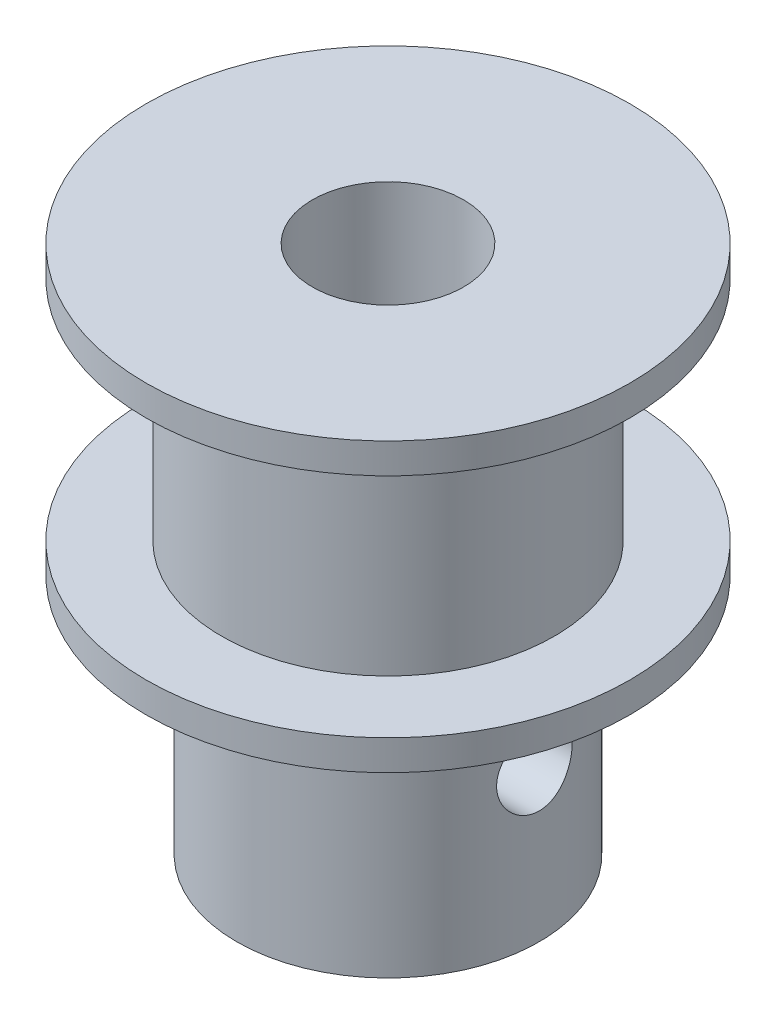
ISO-10303-21;
HEADER;
FILE_DESCRIPTION(('STEP AP214'),'2;1');
FILE_NAME('part.step','',(''),(''),'','','');
FILE_SCHEMA(('AUTOMOTIVE_DESIGN { 1 0 10303 214 1 1 1 1 }'));
ENDSEC;
DATA;
#1=APPLICATION_CONTEXT('core data for automotive mechanical design processes');
#2=APPLICATION_PROTOCOL_DEFINITION('international standard','automotive_design',2000,#1);
#3=PRODUCT_CONTEXT('',#1,'mechanical');
#4=PRODUCT('Part','Part','',(#3));
#5=PRODUCT_RELATED_PRODUCT_CATEGORY('part','',(#4));
#6=PRODUCT_DEFINITION_FORMATION('','',#4);
#7=PRODUCT_DEFINITION_CONTEXT('part definition',#1,'design');
#8=PRODUCT_DEFINITION('design','',#6,#7);
#9=PRODUCT_DEFINITION_SHAPE('','',#8);
#10=(LENGTH_UNIT() NAMED_UNIT(*) SI_UNIT(.MILLI.,.METRE.));
#11=(NAMED_UNIT(*) PLANE_ANGLE_UNIT() SI_UNIT($,.RADIAN.));
#12=(NAMED_UNIT(*) SI_UNIT($,.STERADIAN.) SOLID_ANGLE_UNIT());
#13=UNCERTAINTY_MEASURE_WITH_UNIT(LENGTH_MEASURE(1.E-05),#10,'distance_accuracy_value','');
#14=(GEOMETRIC_REPRESENTATION_CONTEXT(3) GLOBAL_UNCERTAINTY_ASSIGNED_CONTEXT((#13)) GLOBAL_UNIT_ASSIGNED_CONTEXT((#10,
#11,#12)) REPRESENTATION_CONTEXT('',''));
#15=CARTESIAN_POINT('',(0.,0.,0.));
#16=DIRECTION('',(0.,0.,1.));
#17=DIRECTION('',(1.,0.,0.));
#18=AXIS2_PLACEMENT_3D('',#15,#16,#17);
#19=CARTESIAN_POINT('',(0.,0.,0.));
#20=DIRECTION('',(0.,-1.,0.));
#21=DIRECTION('',(0.,0.,-1.));
#22=AXIS2_PLACEMENT_3D('',#19,#20,#21);
#23=CYLINDRICAL_SURFACE('',#22,2.5);
#24=CARTESIAN_POINT('',(2.16506350946109,5.,1.25000000000001));
#25=CARTESIAN_POINT('',(2.16506918410573,4.93486523975594,1.24999545384317));
#26=CARTESIAN_POINT('',(2.16804751484695,4.86964823559369,1.24487496341653));
#27=CARTESIAN_POINT('',(2.17952958065065,4.74121591915356,1.22465401237257));
#28=CARTESIAN_POINT('',(2.18804492569449,4.67800510619574,1.20953258069273));
#29=CARTESIAN_POINT('',(2.20936683256748,4.55568541957007,1.17012493587477));
#30=CARTESIAN_POINT('',(2.22215054341565,4.49655668440802,1.14588744061717));
#31=CARTESIAN_POINT('',(2.25053331021072,4.3832197475041,1.08908440672047));
#32=CARTESIAN_POINT('',(2.2661325184508,4.32901181217193,1.05651841754472));
#33=CARTESIAN_POINT('',(2.29996086321801,4.22211783930312,0.980833175663607));
#34=CARTESIAN_POINT('',(2.31830079547442,4.16992608040807,0.937065045179721));
#35=CARTESIAN_POINT('',(2.35464978482132,4.07323951449161,0.841567259518094));
#36=CARTESIAN_POINT('',(2.37265867289062,4.0287485467706,0.789833657227875));
#37=CARTESIAN_POINT('',(2.40776846191186,3.94579106106542,0.675611954268192));
#38=CARTESIAN_POINT('',(2.42472633022715,3.90793279017559,0.612633986265728));
#39=CARTESIAN_POINT('',(2.45438445124411,3.8435739334428,0.480196283249389));
#40=CARTESIAN_POINT('',(2.46708738979677,3.81706617982854,0.410740672672703));
#41=CARTESIAN_POINT('',(2.48600576555297,3.77811917337363,0.27255617990748));
#42=CARTESIAN_POINT('',(2.49261850276115,3.76481309205558,0.204127238111031));
#43=CARTESIAN_POINT('',(2.50009479807584,3.7497923516562,0.0657132858723191));
#44=CARTESIAN_POINT('',(2.50096183480737,3.74807067900536,-0.00427075730466423));
#45=CARTESIAN_POINT('',(2.49703727395563,3.75593334246294,-0.137290655529679));
#46=CARTESIAN_POINT('',(2.49273119865201,3.76454751940153,-0.20040149897098));
#47=CARTESIAN_POINT('',(2.47967806574684,3.79110105488082,-0.324142214897894));
#48=CARTESIAN_POINT('',(2.47093067582992,3.80904111122028,-0.384771901367398));
#49=CARTESIAN_POINT('',(2.44964479109568,3.85385320761227,-0.502886739461933));
#50=CARTESIAN_POINT('',(2.43705551911499,3.88084539146508,-0.560316779393964));
#51=CARTESIAN_POINT('',(2.40922057483359,3.94282927025187,-0.669971001891652));
#52=CARTESIAN_POINT('',(2.39397395196855,3.97782382912794,-0.722193311048299));
#53=CARTESIAN_POINT('',(2.36055492999037,4.05861918941627,-0.825217076122735));
#54=CARTESIAN_POINT('',(2.34224219997719,4.10512878540751,-0.875417593786692));
#55=CARTESIAN_POINT('',(2.30567925733515,4.20573715616272,-0.967630462872217));
#56=CARTESIAN_POINT('',(2.28742910332036,4.25984171534258,-1.00963651446778));
#57=CARTESIAN_POINT('',(2.25180195115606,4.37831024053011,-1.08688166830276));
#58=CARTESIAN_POINT('',(2.23455399988385,4.44310752881776,-1.12152164372256));
#59=CARTESIAN_POINT('',(2.2046931284822,4.57867208919875,-1.17914889125153));
#60=CARTESIAN_POINT('',(2.19207537557585,4.64943304127195,-1.2021483227636));
#61=CARTESIAN_POINT('',(2.17430794771293,4.78901813910349,-1.23397526378129));
#62=CARTESIAN_POINT('',(2.16864569810621,4.85755139880444,-1.24378140264996));
#63=CARTESIAN_POINT('',(2.16397399202012,4.99550167689568,-1.25189618326428));
#64=CARTESIAN_POINT('',(2.1649598361164,5.06491803639973,-1.25021294664377));
#65=CARTESIAN_POINT('',(2.17292920675731,5.19456739822341,-1.23629505417995));
#66=CARTESIAN_POINT('',(2.17924484383318,5.25497431388491,-1.22523477089058));
#67=CARTESIAN_POINT('',(2.19617526939177,5.3729597328387,-1.19462035579054));
#68=CARTESIAN_POINT('',(2.20679145006293,5.43053731343326,-1.17506347327951));
#69=CARTESIAN_POINT('',(2.23170277599571,5.54426416362837,-1.1270594857561));
#70=CARTESIAN_POINT('',(2.24614554053829,5.60022377106694,-1.0982425796159));
#71=CARTESIAN_POINT('',(2.27695149371562,5.70683658942374,-1.03285883001975));
#72=CARTESIAN_POINT('',(2.29331566693935,5.7574870543916,-0.996288005415263));
#73=CARTESIAN_POINT('',(2.3285999807042,5.85872345940444,-0.911046458998559));
#74=CARTESIAN_POINT('',(2.34758228942862,5.90849643839707,-0.8614315903937));
#75=CARTESIAN_POINT('',(2.38417793722366,5.99926529749199,-0.754255619247853));
#76=CARTESIAN_POINT('',(2.40179081259637,6.04025821278818,-0.696691843319175));
#77=CARTESIAN_POINT('',(2.43426702113696,6.11321715743763,-0.573169203198437));
#78=CARTESIAN_POINT('',(2.44904552090037,6.14491639776364,-0.507028871967632));
#79=CARTESIAN_POINT('',(2.47354193699126,6.19642237982174,-0.369402955801344));
#80=CARTESIAN_POINT('',(2.48326429595466,6.21623956420788,-0.297922126740211));
#81=CARTESIAN_POINT('',(2.49584385227353,6.24171070521833,-0.158724602913012));
#82=CARTESIAN_POINT('',(2.49924909885239,6.24849734484514,-0.0912643048130621));
#83=CARTESIAN_POINT('',(2.50052662968914,6.251054081818,0.0439074824390136));
#84=CARTESIAN_POINT('',(2.49840085083612,6.24682803565446,0.111618875368868));
#85=CARTESIAN_POINT('',(2.48917461047403,6.22822949150547,0.240672490396443));
#86=CARTESIAN_POINT('',(2.48241118334987,6.21454393842791,0.302140397264089));
#87=CARTESIAN_POINT('',(2.46490117079279,6.17834125087129,0.421807440229531));
#88=CARTESIAN_POINT('',(2.45415401415994,6.15582284988318,0.480006106194395));
#89=CARTESIAN_POINT('',(2.4290741343515,6.10159118479253,0.594279257806115));
#90=CARTESIAN_POINT('',(2.41460771498499,6.0695258459902,0.650156428375067));
#91=CARTESIAN_POINT('',(2.38360166427282,5.99755258642619,0.75596830226754));
#92=CARTESIAN_POINT('',(2.3670610819795,5.95764106360541,0.805900259268643));
#93=CARTESIAN_POINT('',(2.33160762783284,5.86650357622162,0.903642505196123));
#94=CARTESIAN_POINT('',(2.31262248764622,5.81454689065351,0.950747105674098));
#95=CARTESIAN_POINT('',(2.27578845203565,5.70318659858779,1.03582910924335));
#96=CARTESIAN_POINT('',(2.25794057202331,5.64377647391539,1.07379843751258));
#97=CARTESIAN_POINT('',(2.22499506631145,5.51670419177381,1.14053884973208));
#98=CARTESIAN_POINT('',(2.21000217820337,5.44884058608908,1.16898133245118));
#99=CARTESIAN_POINT('',(2.18582695410439,5.30833449457528,1.21359838688302));
#100=CARTESIAN_POINT('',(2.17662520184627,5.23570888885914,1.22981398896919));
#101=CARTESIAN_POINT('',(2.16911590752238,5.135243305435,1.24295875983053));
#102=CARTESIAN_POINT('',(2.16760161256439,5.10829013200265,1.24559513120482));
#103=CARTESIAN_POINT('',(2.16557419859687,5.0542293991472,1.24911675636246));
#104=CARTESIAN_POINT('',(2.16506114656386,5.02712182951766,1.25000189299985));
#105=CARTESIAN_POINT('',(2.16506350946109,5.,1.25000000000001));
#106=B_SPLINE_CURVE_WITH_KNOTS('',3,(#24,#25,#26,#27,#28,#29,#30,#31,#32,#33,#34,#35,#36,#37,
#38,#39,#40,#41,#42,#43,#44,#45,#46,#47,#48,#49,#50,#51,#52,#53,#54,#55,#56,#57,#58,#59,#60,#61,
#62,#63,#64,#65,#66,#67,#68,#69,#70,#71,#72,#73,#74,#75,#76,#77,#78,#79,#80,#81,#82,#83,#84,#85,
#86,#87,#88,#89,#90,#91,#92,#93,#94,#95,#96,#97,#98,#99,#100,#101,#102,#103,#104,#105),
.UNSPECIFIED.,.T.,.F.,(4,2,2,2,2,2,2,2,2,2,2,2,2,2,2,2,2,2,2,2,2,2,2,2,2,2,2,2,2,2,2,2,2,2,2,2,
2,2,2,2,4),(0.,0.195290153243395,0.390991116031006,0.585660744898607,0.780340906806438,
0.991077890622793,1.20191963855464,1.42697365298454,1.65188533704864,1.86079356209919,
2.0695752960755,2.26020121855673,2.45084140646819,2.64411918413933,2.8374662418784,
3.04908989321113,3.26087560307398,3.48611052161811,3.71110967764631,3.91827863567765,
4.12530116485466,4.30967729280032,4.49411315545079,4.6870912050761,4.88016857775059,
5.09758429475767,5.31507331222753,5.53830226766207,5.76133474760965,5.96390337986859,
6.16640108492465,6.35555531089366,6.54473666890016,6.7420093839934,6.93937287625899,
7.15637802312585,7.37357428556443,7.59763436298257,7.82093916253451,7.90225168981637,
7.98356965618176),.UNSPECIFIED.);
#107=CARTESIAN_POINT('',(2.16506350946109,5.,1.25000000000001));
#108=VERTEX_POINT('',#107);
#109=EDGE_CURVE('E104',#108,#108,#106,.T.);
#110=ORIENTED_EDGE('',*,*,#109,.T.);
#111=EDGE_LOOP('',(#110));
#112=FACE_BOUND('',#111,.T.);
#113=CARTESIAN_POINT('',(1.25,5.,-2.1650635094611));
#114=CARTESIAN_POINT('',(1.24999545384316,4.93486523975594,-2.16506918410574));
#115=CARTESIAN_POINT('',(1.24487496341652,4.86964823559369,-2.16804751484696));
#116=CARTESIAN_POINT('',(1.22465401237257,4.74121591915356,-2.17952958065065));
#117=CARTESIAN_POINT('',(1.20953258069272,4.67800510619574,-2.18804492569449));
#118=CARTESIAN_POINT('',(1.17012493587477,4.55568541957007,-2.20936683256748));
#119=CARTESIAN_POINT('',(1.14588744061716,4.49655668440802,-2.22215054341565));
#120=CARTESIAN_POINT('',(1.08908440672047,4.3832197475041,-2.25053331021072));
#121=CARTESIAN_POINT('',(1.05651841754472,4.32901181217193,-2.26613251845081));
#122=CARTESIAN_POINT('',(0.980833175663598,4.22211783930312,-2.29996086321802));
#123=CARTESIAN_POINT('',(0.937065045179713,4.16992608040807,-2.31830079547442));
#124=CARTESIAN_POINT('',(0.841567259518085,4.07323951449161,-2.35464978482132));
#125=CARTESIAN_POINT('',(0.789833657227866,4.0287485467706,-2.37265867289062));
#126=CARTESIAN_POINT('',(0.675611954268182,3.94579106106542,-2.40776846191186));
#127=CARTESIAN_POINT('',(0.612633986265718,3.90793279017559,-2.42472633022716));
#128=CARTESIAN_POINT('',(0.48019628324938,3.8435739334428,-2.45438445124411));
#129=CARTESIAN_POINT('',(0.410740672672694,3.81706617982854,-2.46708738979677));
#130=CARTESIAN_POINT('',(0.272556179907472,3.77811917337363,-2.48600576555297));
#131=CARTESIAN_POINT('',(0.204127238111022,3.76481309205558,-2.49261850276115));
#132=CARTESIAN_POINT('',(0.0657132858723103,3.7497923516562,-2.50009479807584));
#133=CARTESIAN_POINT('',(-0.00427075730467304,3.74807067900536,-2.50096183480737));
#134=CARTESIAN_POINT('',(-0.137290655529687,3.75593334246294,-2.49703727395563));
#135=CARTESIAN_POINT('',(-0.200401498970989,3.76454751940153,-2.492731198652));
#136=CARTESIAN_POINT('',(-0.324142214897902,3.79110105488082,-2.47967806574684));
#137=CARTESIAN_POINT('',(-0.384771901367407,3.80904111122028,-2.47093067582992));
#138=CARTESIAN_POINT('',(-0.502886739461942,3.85385320761227,-2.44964479109568));
#139=CARTESIAN_POINT('',(-0.560316779393973,3.88084539146508,-2.43705551911499));
#140=CARTESIAN_POINT('',(-0.669971001891661,3.94282927025187,-2.40922057483359));
#141=CARTESIAN_POINT('',(-0.722193311048307,3.97782382912794,-2.39397395196855));
#142=CARTESIAN_POINT('',(-0.825217076122744,4.05861918941627,-2.36055492999036));
#143=CARTESIAN_POINT('',(-0.875417593786701,4.10512878540751,-2.34224219997719));
#144=CARTESIAN_POINT('',(-0.967630462872225,4.20573715616272,-2.30567925733515));
#145=CARTESIAN_POINT('',(-1.00963651446779,4.25984171534258,-2.28742910332036));
#146=CARTESIAN_POINT('',(-1.08688166830276,4.37831024053011,-2.25180195115606));
#147=CARTESIAN_POINT('',(-1.12152164372256,4.44310752881776,-2.23455399988384));
#148=CARTESIAN_POINT('',(-1.17914889125154,4.57867208919875,-2.2046931284822));
#149=CARTESIAN_POINT('',(-1.20214832276361,4.64943304127195,-2.19207537557584));
#150=CARTESIAN_POINT('',(-1.2339752637813,4.78901813910349,-2.17430794771293));
#151=CARTESIAN_POINT('',(-1.24378140264997,4.85755139880444,-2.1686456981062));
#152=CARTESIAN_POINT('',(-1.25189618326428,4.99550167689568,-2.16397399202012));
#153=CARTESIAN_POINT('',(-1.25021294664378,5.06491803639973,-2.16495983611639));
#154=CARTESIAN_POINT('',(-1.23629505417996,5.19456739822341,-2.17292920675731));
#155=CARTESIAN_POINT('',(-1.22523477089058,5.25497431388491,-2.17924484383318));
#156=CARTESIAN_POINT('',(-1.19462035579055,5.3729597328387,-2.19617526939176));
#157=CARTESIAN_POINT('',(-1.17506347327952,5.43053731343326,-2.20679145006292));
#158=CARTESIAN_POINT('',(-1.12705948575611,5.54426416362837,-2.23170277599571));
#159=CARTESIAN_POINT('',(-1.0982425796159,5.60022377106694,-2.24614554053829));
#160=CARTESIAN_POINT('',(-1.03285883001976,5.70683658942374,-2.27695149371562));
#161=CARTESIAN_POINT('',(-0.996288005415271,5.7574870543916,-2.29331566693934));
#162=CARTESIAN_POINT('',(-0.911046458998567,5.85872345940444,-2.3285999807042));
#163=CARTESIAN_POINT('',(-0.861431590393709,5.90849643839707,-2.34758228942861));
#164=CARTESIAN_POINT('',(-0.754255619247861,5.99926529749199,-2.38417793722366));
#165=CARTESIAN_POINT('',(-0.696691843319184,6.04025821278818,-2.40179081259637));
#166=CARTESIAN_POINT('',(-0.573169203198446,6.11321715743763,-2.43426702113696));
#167=CARTESIAN_POINT('',(-0.507028871967641,6.14491639776364,-2.44904552090037));
#168=CARTESIAN_POINT('',(-0.369402955801352,6.19642237982174,-2.47354193699126));
#169=CARTESIAN_POINT('',(-0.29792212674022,6.21623956420788,-2.48326429595466));
#170=CARTESIAN_POINT('',(-0.158724602913021,6.24171070521833,-2.49584385227353));
#171=CARTESIAN_POINT('',(-0.0912643048130714,6.24849734484514,-2.49924909885239));
#172=CARTESIAN_POINT('',(0.0439074824390044,6.251054081818,-2.50052662968914));
#173=CARTESIAN_POINT('',(0.111618875368858,6.24682803565446,-2.49840085083612));
#174=CARTESIAN_POINT('',(0.240672490396434,6.22822949150547,-2.48917461047403));
#175=CARTESIAN_POINT('',(0.30214039726408,6.21454393842791,-2.48241118334987));
#176=CARTESIAN_POINT('',(0.421807440229522,6.17834125087129,-2.46490117079279));
#177=CARTESIAN_POINT('',(0.480006106194386,6.15582284988318,-2.45415401415995));
#178=CARTESIAN_POINT('',(0.594279257806106,6.10159118479253,-2.4290741343515));
#179=CARTESIAN_POINT('',(0.650156428375059,6.0695258459902,-2.41460771498499));
#180=CARTESIAN_POINT('',(0.755968302267532,5.99755258642619,-2.38360166427283));
#181=CARTESIAN_POINT('',(0.805900259268634,5.95764106360541,-2.36706108197951));
#182=CARTESIAN_POINT('',(0.903642505196114,5.86650357622162,-2.33160762783285));
#183=CARTESIAN_POINT('',(0.95074710567409,5.81454689065351,-2.31262248764622));
#184=CARTESIAN_POINT('',(1.03582910924334,5.70318659858779,-2.27578845203565));
#185=CARTESIAN_POINT('',(1.07379843751257,5.6437764739154,-2.25794057202332));
#186=CARTESIAN_POINT('',(1.14053884973207,5.51670419177381,-2.22499506631145));
#187=CARTESIAN_POINT('',(1.16898133245117,5.44884058608908,-2.21000217820338));
#188=CARTESIAN_POINT('',(1.21359838688301,5.30833449457528,-2.18582695410439));
#189=CARTESIAN_POINT('',(1.22981398896918,5.23570888885914,-2.17662520184627));
#190=CARTESIAN_POINT('',(1.24295875983052,5.135243305435,-2.16911590752238));
#191=CARTESIAN_POINT('',(1.24559513120481,5.10829013200265,-2.1676016125644));
#192=CARTESIAN_POINT('',(1.24911675636245,5.0542293991472,-2.16557419859688));
#193=CARTESIAN_POINT('',(1.25000189299984,5.02712182951766,-2.16506114656387));
#194=CARTESIAN_POINT('',(1.25,5.,-2.1650635094611));
#195=B_SPLINE_CURVE_WITH_KNOTS('',3,(#113,#114,#115,#116,#117,#118,#119,#120,#121,#122,#123,
#124,#125,#126,#127,#128,#129,#130,#131,#132,#133,#134,#135,#136,#137,#138,#139,#140,#141,#142,
#143,#144,#145,#146,#147,#148,#149,#150,#151,#152,#153,#154,#155,#156,#157,#158,#159,#160,#161,
#162,#163,#164,#165,#166,#167,#168,#169,#170,#171,#172,#173,#174,#175,#176,#177,#178,#179,#180,
#181,#182,#183,#184,#185,#186,#187,#188,#189,#190,#191,#192,#193,#194),.UNSPECIFIED.,.T.,.F.,(4,
2,2,2,2,2,2,2,2,2,2,2,2,2,2,2,2,2,2,2,2,2,2,2,2,2,2,2,2,2,2,2,2,2,2,2,2,2,2,2,4),(0.,
0.195290153243395,0.390991116031006,0.585660744898607,0.780340906806438,0.991077890622794,
1.20191963855464,1.42697365298454,1.65188533704864,1.86079356209919,2.0695752960755,
2.26020121855673,2.45084140646819,2.64411918413933,2.8374662418784,3.04908989321113,
3.26087560307398,3.48611052161811,3.71110967764631,3.91827863567765,4.12530116485466,
4.30967729280032,4.49411315545079,4.6870912050761,4.88016857775059,5.09758429475767,
5.31507331222753,5.53830226766207,5.76133474760965,5.96390337986859,6.16640108492465,
6.35555531089366,6.54473666890016,6.7420093839934,6.93937287625899,7.15637802312585,
7.37357428556443,7.59763436298256,7.82093916253451,7.90225168981637,7.98356965618176),.UNSPECIFIED.);
#196=CARTESIAN_POINT('',(1.25,5.,-2.1650635094611));
#197=VERTEX_POINT('',#196);
#198=EDGE_CURVE('E71',#197,#197,#195,.T.);
#199=ORIENTED_EDGE('',*,*,#198,.T.);
#200=EDGE_LOOP('',(#199));
#201=FACE_BOUND('',#200,.T.);
#202=CARTESIAN_POINT('',(0.,0.,0.));
#203=DIRECTION('',(0.,-1.,0.));
#204=DIRECTION('',(0.,0.,-1.));
#205=AXIS2_PLACEMENT_3D('',#202,#203,#204);
#206=CIRCLE('',#205,2.5);
#207=CARTESIAN_POINT('',(0.,0.,-2.5));
#208=VERTEX_POINT('',#207);
#209=EDGE_CURVE('E68',#208,#208,#206,.T.);
#210=ORIENTED_EDGE('',*,*,#209,.T.);
#211=EDGE_LOOP('',(#210));
#212=FACE_BOUND('',#211,.T.);
#213=CARTESIAN_POINT('',(0.,17.5,0.));
#214=DIRECTION('',(0.,-1.,0.));
#215=DIRECTION('',(0.,0.,-1.));
#216=AXIS2_PLACEMENT_3D('',#213,#214,#215);
#217=CIRCLE('',#216,2.5);
#218=CARTESIAN_POINT('',(0.,17.5,-2.5));
#219=VERTEX_POINT('',#218);
#220=EDGE_CURVE('E10',#219,#219,#217,.T.);
#221=ORIENTED_EDGE('',*,*,#220,.F.);
#222=EDGE_LOOP('',(#221));
#223=FACE_BOUND('',#222,.T.);
#224=ADVANCED_FACE('F34',(#112,#201,#212,#223),#23,.F.);
#225=CARTESIAN_POINT('',(2.5,17.5,0.));
#226=DIRECTION('',(0.,1.,0.));
#227=DIRECTION('',(0.,0.,1.));
#228=AXIS2_PLACEMENT_3D('',#225,#226,#227);
#229=PLANE('',#228);
#230=ORIENTED_EDGE('',*,*,#220,.T.);
#231=EDGE_LOOP('',(#230));
#232=FACE_BOUND('',#231,.T.);
#233=CARTESIAN_POINT('',(0.,17.5,0.));
#234=DIRECTION('',(0.,-1.,0.));
#235=DIRECTION('',(0.,0.,-1.));
#236=AXIS2_PLACEMENT_3D('',#233,#234,#235);
#237=CIRCLE('',#236,8.);
#238=CARTESIAN_POINT('',(0.,17.5,-8.));
#239=VERTEX_POINT('',#238);
#240=EDGE_CURVE('E40',#239,#239,#237,.T.);
#241=ORIENTED_EDGE('',*,*,#240,.F.);
#242=EDGE_LOOP('',(#241));
#243=FACE_BOUND('',#242,.T.);
#244=ADVANCED_FACE('F134',(#232,#243),#229,.T.);
#245=CARTESIAN_POINT('',(0.,0.,0.));
#246=DIRECTION('',(0.,-1.,0.));
#247=DIRECTION('',(0.,0.,-1.));
#248=AXIS2_PLACEMENT_3D('',#245,#246,#247);
#249=CYLINDRICAL_SURFACE('',#248,8.);
#250=ORIENTED_EDGE('',*,*,#240,.T.);
#251=EDGE_LOOP('',(#250));
#252=FACE_BOUND('',#251,.T.);
#253=CARTESIAN_POINT('',(0.,16.5,0.));
#254=DIRECTION('',(0.,-1.,0.));
#255=DIRECTION('',(0.,0.,-1.));
#256=AXIS2_PLACEMENT_3D('',#253,#254,#255);
#257=CIRCLE('',#256,8.);
#258=CARTESIAN_POINT('',(0.,16.5,-8.));
#259=VERTEX_POINT('',#258);
#260=EDGE_CURVE('E44',#259,#259,#257,.T.);
#261=ORIENTED_EDGE('',*,*,#260,.F.);
#262=EDGE_LOOP('',(#261));
#263=FACE_BOUND('',#262,.T.);
#264=ADVANCED_FACE('F138',(#252,#263),#249,.T.);
#265=CARTESIAN_POINT('',(8.,16.5,0.));
#266=DIRECTION('',(0.,-1.,0.));
#267=DIRECTION('',(0.,0.,-1.));
#268=AXIS2_PLACEMENT_3D('',#265,#266,#267);
#269=PLANE('',#268);
#270=ORIENTED_EDGE('',*,*,#260,.T.);
#271=EDGE_LOOP('',(#270));
#272=FACE_BOUND('',#271,.T.);
#273=CARTESIAN_POINT('',(0.,16.5,0.));
#274=DIRECTION('',(0.,-1.,0.));
#275=DIRECTION('',(0.,0.,-1.));
#276=AXIS2_PLACEMENT_3D('',#273,#274,#275);
#277=CIRCLE('',#276,5.5);
#278=CARTESIAN_POINT('',(0.,16.5,-5.5));
#279=VERTEX_POINT('',#278);
#280=EDGE_CURVE('E48',#279,#279,#277,.T.);
#281=ORIENTED_EDGE('',*,*,#280,.F.);
#282=EDGE_LOOP('',(#281));
#283=FACE_BOUND('',#282,.T.);
#284=ADVANCED_FACE('F212',(#272,#283),#269,.T.);
#285=CARTESIAN_POINT('',(0.,0.,0.));
#286=DIRECTION('',(0.,-1.,0.));
#287=DIRECTION('',(0.,0.,-1.));
#288=AXIS2_PLACEMENT_3D('',#285,#286,#287);
#289=CYLINDRICAL_SURFACE('',#288,5.5);
#290=ORIENTED_EDGE('',*,*,#280,.T.);
#291=EDGE_LOOP('',(#290));
#292=FACE_BOUND('',#291,.T.);
#293=CARTESIAN_POINT('',(0.,9.,0.));
#294=DIRECTION('',(0.,-1.,0.));
#295=DIRECTION('',(0.,0.,-1.));
#296=AXIS2_PLACEMENT_3D('',#293,#294,#295);
#297=CIRCLE('',#296,5.5);
#298=CARTESIAN_POINT('',(0.,9.,-5.5));
#299=VERTEX_POINT('',#298);
#300=EDGE_CURVE('E53',#299,#299,#297,.T.);
#301=ORIENTED_EDGE('',*,*,#300,.F.);
#302=EDGE_LOOP('',(#301));
#303=FACE_BOUND('',#302,.T.);
#304=ADVANCED_FACE('F202',(#292,#303),#289,.T.);
#305=CARTESIAN_POINT('',(5.5,9.,0.));
#306=DIRECTION('',(0.,1.,0.));
#307=DIRECTION('',(0.,0.,1.));
#308=AXIS2_PLACEMENT_3D('',#305,#306,#307);
#309=PLANE('',#308);
#310=ORIENTED_EDGE('',*,*,#300,.T.);
#311=EDGE_LOOP('',(#310));
#312=FACE_BOUND('',#311,.T.);
#313=CARTESIAN_POINT('',(0.,9.,0.));
#314=DIRECTION('',(0.,-1.,0.));
#315=DIRECTION('',(0.,0.,-1.));
#316=AXIS2_PLACEMENT_3D('',#313,#314,#315);
#317=CIRCLE('',#316,8.);
#318=CARTESIAN_POINT('',(0.,9.,-8.));
#319=VERTEX_POINT('',#318);
#320=EDGE_CURVE('E56',#319,#319,#317,.T.);
#321=ORIENTED_EDGE('',*,*,#320,.F.);
#322=EDGE_LOOP('',(#321));
#323=FACE_BOUND('',#322,.T.);
#324=ADVANCED_FACE('F192',(#312,#323),#309,.T.);
#325=CARTESIAN_POINT('',(0.,0.,0.));
#326=DIRECTION('',(0.,-1.,0.));
#327=DIRECTION('',(0.,0.,-1.));
#328=AXIS2_PLACEMENT_3D('',#325,#326,#327);
#329=CYLINDRICAL_SURFACE('',#328,8.);
#330=ORIENTED_EDGE('',*,*,#320,.T.);
#331=EDGE_LOOP('',(#330));
#332=FACE_BOUND('',#331,.T.);
#333=CARTESIAN_POINT('',(0.,8.,0.));
#334=DIRECTION('',(0.,-1.,0.));
#335=DIRECTION('',(0.,0.,-1.));
#336=AXIS2_PLACEMENT_3D('',#333,#334,#335);
#337=CIRCLE('',#336,8.);
#338=CARTESIAN_POINT('',(0.,8.,-8.));
#339=VERTEX_POINT('',#338);
#340=EDGE_CURVE('E59',#339,#339,#337,.T.);
#341=ORIENTED_EDGE('',*,*,#340,.F.);
#342=EDGE_LOOP('',(#341));
#343=FACE_BOUND('',#342,.T.);
#344=ADVANCED_FACE('F182',(#332,#343),#329,.T.);
#345=CARTESIAN_POINT('',(8.,8.,0.));
#346=DIRECTION('',(0.,-1.,0.));
#347=DIRECTION('',(0.,0.,-1.));
#348=AXIS2_PLACEMENT_3D('',#345,#346,#347);
#349=PLANE('',#348);
#350=ORIENTED_EDGE('',*,*,#340,.T.);
#351=EDGE_LOOP('',(#350));
#352=FACE_BOUND('',#351,.T.);
#353=CARTESIAN_POINT('',(0.,8.,0.));
#354=DIRECTION('',(0.,-1.,0.));
#355=DIRECTION('',(0.,0.,-1.));
#356=AXIS2_PLACEMENT_3D('',#353,#354,#355);
#357=CIRCLE('',#356,5.);
#358=CARTESIAN_POINT('',(0.,8.,-5.));
#359=VERTEX_POINT('',#358);
#360=EDGE_CURVE('E62',#359,#359,#357,.T.);
#361=ORIENTED_EDGE('',*,*,#360,.F.);
#362=EDGE_LOOP('',(#361));
#363=FACE_BOUND('',#362,.T.);
#364=ADVANCED_FACE('F120',(#352,#363),#349,.T.);
#365=CARTESIAN_POINT('',(0.,0.,0.));
#366=DIRECTION('',(0.,-1.,0.));
#367=DIRECTION('',(0.,0.,-1.));
#368=AXIS2_PLACEMENT_3D('',#365,#366,#367);
#369=CYLINDRICAL_SURFACE('',#368,5.);
#370=CARTESIAN_POINT('',(4.84122918275927,5.,1.25000000000002));
#371=CARTESIAN_POINT('',(4.84123050042654,5.0690253754623,1.24999803929591));
#372=CARTESIAN_POINT('',(4.84272153006956,5.138072449339,1.24426312274867));
#373=CARTESIAN_POINT('',(4.84850930996624,5.27418378908702,1.22151156273209));
#374=CARTESIAN_POINT('',(4.85280769310906,5.34124687723416,1.20448835337112));
#375=CARTESIAN_POINT('',(4.86369362297983,5.47140176909352,1.15974559981599));
#376=CARTESIAN_POINT('',(4.87027821345204,5.53449857769284,1.13203986392725));
#377=CARTESIAN_POINT('',(4.88499096014404,5.65515542626996,1.06676057063072));
#378=CARTESIAN_POINT('',(4.89311918189251,5.71271523104011,1.02918659428036));
#379=CARTESIAN_POINT('',(4.91020358177805,5.8219308226311,0.944354213655954));
#380=CARTESIAN_POINT('',(4.91917298811515,5.87344680017502,0.896918443852042));
#381=CARTESIAN_POINT('',(4.93681437757648,5.96788069718017,0.794091032050349));
#382=CARTESIAN_POINT('',(4.94548633283194,6.01079781281087,0.738698647090171));
#383=CARTESIAN_POINT('',(4.96170207760291,6.08738773381564,0.620572600539494));
#384=CARTESIAN_POINT('',(4.96922843700296,6.12092319408073,0.557747288097577));
#385=CARTESIAN_POINT('',(4.98215405962992,6.17690482207654,0.427131592146399));
#386=CARTESIAN_POINT('',(4.98755363667172,6.19935262595776,0.359341942895988));
#387=CARTESIAN_POINT('',(4.9955237942409,6.23207391728929,0.222179379377099));
#388=CARTESIAN_POINT('',(4.99814946922157,6.24258482216329,0.152866359774505));
#389=CARTESIAN_POINT('',(5.00046797053649,6.25187918963778,0.0134144096314023));
#390=CARTESIAN_POINT('',(5.00016123048352,6.2506643861048,-0.0567243972690167));
#391=CARTESIAN_POINT('',(4.99669047476767,6.23671257487493,-0.194190308965467));
#392=CARTESIAN_POINT('',(4.99359001170437,6.22423183747307,-0.261545269501316));
#393=CARTESIAN_POINT('',(4.98495418262427,6.18851436497575,-0.39317280926709));
#394=CARTESIAN_POINT('',(4.97941868699221,6.1652770573113,-0.45744522421303));
#395=CARTESIAN_POINT('',(4.96643754850448,6.10849871465647,-0.581758379377241));
#396=CARTESIAN_POINT('',(4.95897509847527,6.07486647766913,-0.641755637208114));
#397=CARTESIAN_POINT('',(4.94294951904825,5.99832216044187,-0.755344527925594));
#398=CARTESIAN_POINT('',(4.93438619826245,5.95540846571969,-0.808935043856865));
#399=CARTESIAN_POINT('',(4.91681856884761,5.86014562900881,-0.909717543856179));
#400=CARTESIAN_POINT('',(4.90780859762959,5.80757255382611,-0.956697098843982));
#401=CARTESIAN_POINT('',(4.89057521758354,5.69520001322987,-1.04122046995376));
#402=CARTESIAN_POINT('',(4.88235184552986,5.6354002102545,-1.0787638450575));
#403=CARTESIAN_POINT('',(4.86760248415825,5.50985498292552,-1.14348516127823));
#404=CARTESIAN_POINT('',(4.86108491862861,5.4440821348434,-1.1706119587131));
#405=CARTESIAN_POINT('',(4.85059320069979,5.30870726596177,-1.21335702579541));
#406=CARTESIAN_POINT('',(4.8466185040511,5.23910606800843,-1.22897775819112));
#407=CARTESIAN_POINT('',(4.84177678019571,5.10002024923844,-1.24791481933257));
#408=CARTESIAN_POINT('',(4.84083044546825,5.03058110333519,-1.2515452369598));
#409=CARTESIAN_POINT('',(4.8419367174052,4.89208903171092,-1.24725849525776));
#410=CARTESIAN_POINT('',(4.84398904800633,4.82303607102438,-1.23934239892438));
#411=CARTESIAN_POINT('',(4.85078540977281,4.68844286752265,-1.21246273196881));
#412=CARTESIAN_POINT('',(4.85548485117188,4.62286363671458,-1.19368203414086));
#413=CARTESIAN_POINT('',(4.86700359135482,4.49578427107416,-1.14580904083529));
#414=CARTESIAN_POINT('',(4.87382314124307,4.43428462047233,-1.11671552385626));
#415=CARTESIAN_POINT('',(4.88898068546632,4.31577936106633,-1.04838533396826));
#416=CARTESIAN_POINT('',(4.89734584303321,4.25888557997845,-1.0089608769178));
#417=CARTESIAN_POINT('',(4.91458541535858,4.15240581859932,-0.921325366168052));
#418=CARTESIAN_POINT('',(4.92345991364235,4.10282104167496,-0.873112868506782));
#419=CARTESIAN_POINT('',(4.94098701515803,4.01109447871452,-0.767828401230889));
#420=CARTESIAN_POINT('',(4.94962851030918,3.96916996872559,-0.710564940664473));
#421=CARTESIAN_POINT('',(4.96548608306867,3.89553206652438,-0.589628353368326));
#422=CARTESIAN_POINT('',(4.9727022350198,3.8638181416959,-0.525955561196971));
#423=CARTESIAN_POINT('',(4.98485057869157,3.81177698273603,-0.394447752163845));
#424=CARTESIAN_POINT('',(4.98979915011205,3.79136785781047,-0.326646726284834));
#425=CARTESIAN_POINT('',(4.99692646697894,3.76226983269579,-0.188437200398492));
#426=CARTESIAN_POINT('',(4.99910574696704,3.75357867063047,-0.118029206301537));
#427=CARTESIAN_POINT('',(5.00042711761014,3.74829051303058,0.0213544080541759));
#428=CARTESIAN_POINT('',(4.9996497360001,3.75137286363076,0.0903172837075593));
#429=CARTESIAN_POINT('',(4.9953237057178,3.76880978411791,0.226709370518442));
#430=CARTESIAN_POINT('',(4.99177513946369,3.78316401876638,0.294138627226126));
#431=CARTESIAN_POINT('',(4.98231791067453,3.82256527471366,0.425213794556038));
#432=CARTESIAN_POINT('',(4.97642205628333,3.84755431664328,0.488878118226291));
#433=CARTESIAN_POINT('',(4.9628911114173,3.90746322377416,0.611146316301853));
#434=CARTESIAN_POINT('',(4.9552558017217,3.94238434083696,0.669749551581332));
#435=CARTESIAN_POINT('',(4.93884062101666,4.02214404249634,0.781752410529892));
#436=CARTESIAN_POINT('',(4.93003771182014,4.06720017863422,0.834993735375748));
#437=CARTESIAN_POINT('',(4.91238311316552,4.16552856496725,0.933268775339087));
#438=CARTESIAN_POINT('',(4.90353141190695,4.21880289512238,0.978300406335254));
#439=CARTESIAN_POINT('',(4.88659344825685,4.33325176775167,1.05970253309905));
#440=CARTESIAN_POINT('',(4.87852454662355,4.39455515426578,1.0958957743082));
#441=CARTESIAN_POINT('',(4.86429944438269,4.52256936240338,1.1574086207696));
#442=CARTESIAN_POINT('',(4.85814185308378,4.58927620763343,1.18273613719967));
#443=CARTESIAN_POINT('',(4.84939885924729,4.7132212647834,1.21802816070682));
#444=CARTESIAN_POINT('',(4.84635828750683,4.76986645547983,1.22999146324424));
#445=CARTESIAN_POINT('',(4.84227298231965,4.88433608624995,1.2459778657166));
#446=CARTESIAN_POINT('',(4.84122807862453,4.94216042530633,1.25000164296525));
#447=CARTESIAN_POINT('',(4.84122918275927,5.,1.25000000000002));
#448=B_SPLINE_CURVE_WITH_KNOTS('',3,(#370,#371,#372,#373,#374,#375,#376,#377,#378,#379,#380,
#381,#382,#383,#384,#385,#386,#387,#388,#389,#390,#391,#392,#393,#394,#395,#396,#397,#398,#399,
#400,#401,#402,#403,#404,#405,#406,#407,#408,#409,#410,#411,#412,#413,#414,#415,#416,#417,#418,
#419,#420,#421,#422,#423,#424,#425,#426,#427,#428,#429,#430,#431,#432,#433,#434,#435,#436,#437,
#438,#439,#440,#441,#442,#443,#444,#445,#446,#447),.UNSPECIFIED.,.T.,.F.,(4,2,2,2,2,2,2,2,2,2,2,
2,2,2,2,2,2,2,2,2,2,2,2,2,2,2,2,2,2,2,2,2,2,2,2,2,2,2,4),(0.,0.206863720868067,
0.413847870714333,0.620565363583011,0.827291633777393,1.03811977096488,1.24896760739933,
1.4627574819896,1.67651579923546,1.88594375497673,2.0953407433301,2.30009131344474,
2.50485278362393,2.71146437127222,2.91811192734457,3.13035233285956,3.34260265599901,
3.55588216004201,3.76911600064774,3.97671787380859,4.18430063591901,4.38848702504604,
4.59269760710709,4.80091422929579,5.00916509442523,5.2226266548266,5.43607707859777,
5.64796036403465,5.85980274454519,6.06591723063729,6.27202558688491,6.47702438279856,
6.68204902869036,6.89198548291036,7.10197515782755,7.31588238642339,7.5296336068331,
7.70298913588665,7.87632987549761),.UNSPECIFIED.);
#449=CARTESIAN_POINT('',(4.84122918275927,5.,1.25000000000002));
#450=VERTEX_POINT('',#449);
#451=EDGE_CURVE('E100',#450,#450,#448,.T.);
#452=ORIENTED_EDGE('',*,*,#451,.T.);
#453=EDGE_LOOP('',(#452));
#454=FACE_BOUND('',#453,.T.);
#455=CARTESIAN_POINT('',(1.25,5.,-4.84122918275927));
#456=CARTESIAN_POINT('',(1.24999803929589,5.0690253754623,-4.84123050042654));
#457=CARTESIAN_POINT('',(1.24426312274865,5.138072449339,-4.84272153006957));
#458=CARTESIAN_POINT('',(1.22151156273207,5.27418378908702,-4.84850930996624));
#459=CARTESIAN_POINT('',(1.2044883533711,5.34124687723416,-4.85280769310907));
#460=CARTESIAN_POINT('',(1.15974559981597,5.47140176909352,-4.86369362297984));
#461=CARTESIAN_POINT('',(1.13203986392723,5.53449857769284,-4.87027821345204));
#462=CARTESIAN_POINT('',(1.0667605706307,5.65515542626996,-4.88499096014404));
#463=CARTESIAN_POINT('',(1.02918659428035,5.71271523104011,-4.89311918189251));
#464=CARTESIAN_POINT('',(0.944354213655937,5.8219308226311,-4.91020358177806));
#465=CARTESIAN_POINT('',(0.896918443852024,5.87344680017502,-4.91917298811515));
#466=CARTESIAN_POINT('',(0.794091032050331,5.96788069718017,-4.93681437757649));
#467=CARTESIAN_POINT('',(0.738698647090152,6.01079781281087,-4.94548633283195));
#468=CARTESIAN_POINT('',(0.620572600539476,6.08738773381564,-4.96170207760291));
#469=CARTESIAN_POINT('',(0.557747288097559,6.12092319408073,-4.96922843700296));
#470=CARTESIAN_POINT('',(0.427131592146381,6.17690482207654,-4.98215405962992));
#471=CARTESIAN_POINT('',(0.35934194289597,6.19935262595776,-4.98755363667172));
#472=CARTESIAN_POINT('',(0.222179379377081,6.23207391728929,-4.9955237942409));
#473=CARTESIAN_POINT('',(0.152866359774488,6.24258482216329,-4.99814946922157));
#474=CARTESIAN_POINT('',(0.0134144096313846,6.25187918963778,-5.00046797053649));
#475=CARTESIAN_POINT('',(-0.0567243972690342,6.2506643861048,-5.00016123048352));
#476=CARTESIAN_POINT('',(-0.194190308965484,6.23671257487493,-4.99669047476767));
#477=CARTESIAN_POINT('',(-0.261545269501334,6.22423183747307,-4.99359001170437));
#478=CARTESIAN_POINT('',(-0.393172809267108,6.18851436497575,-4.98495418262427));
#479=CARTESIAN_POINT('',(-0.457445224213047,6.1652770573113,-4.97941868699221));
#480=CARTESIAN_POINT('',(-0.581758379377258,6.10849871465647,-4.96643754850448));
#481=CARTESIAN_POINT('',(-0.64175563720813,6.07486647766913,-4.95897509847527));
#482=CARTESIAN_POINT('',(-0.755344527925611,5.99832216044187,-4.94294951904825));
#483=CARTESIAN_POINT('',(-0.808935043856882,5.95540846571969,-4.93438619826245));
#484=CARTESIAN_POINT('',(-0.909717543856195,5.86014562900881,-4.9168185688476));
#485=CARTESIAN_POINT('',(-0.956697098843999,5.80757255382611,-4.90780859762959));
#486=CARTESIAN_POINT('',(-1.04122046995377,5.69520001322987,-4.89057521758353));
#487=CARTESIAN_POINT('',(-1.07876384505752,5.6354002102545,-4.88235184552985));
#488=CARTESIAN_POINT('',(-1.14348516127825,5.50985498292552,-4.86760248415824));
#489=CARTESIAN_POINT('',(-1.17061195871311,5.4440821348434,-4.8610849186286));
#490=CARTESIAN_POINT('',(-1.21335702579543,5.30870726596177,-4.85059320069979));
#491=CARTESIAN_POINT('',(-1.22897775819114,5.23910606800843,-4.84661850405109));
#492=CARTESIAN_POINT('',(-1.24791481933259,5.10002024923844,-4.8417767801957));
#493=CARTESIAN_POINT('',(-1.25154523695981,5.03058110333519,-4.84083044546824));
#494=CARTESIAN_POINT('',(-1.24725849525777,4.89208903171092,-4.8419367174052));
#495=CARTESIAN_POINT('',(-1.2393423989244,4.82303607102438,-4.84398904800633));
#496=CARTESIAN_POINT('',(-1.21246273196883,4.68844286752265,-4.8507854097728));
#497=CARTESIAN_POINT('',(-1.19368203414087,4.62286363671458,-4.85548485117188));
#498=CARTESIAN_POINT('',(-1.14580904083531,4.49578427107416,-4.86700359135481));
#499=CARTESIAN_POINT('',(-1.11671552385627,4.43428462047233,-4.87382314124307));
#500=CARTESIAN_POINT('',(-1.04838533396828,4.31577936106633,-4.88898068546631));
#501=CARTESIAN_POINT('',(-1.00896087691781,4.25888557997845,-4.89734584303321));
#502=CARTESIAN_POINT('',(-0.921325366168069,4.15240581859932,-4.91458541535858));
#503=CARTESIAN_POINT('',(-0.873112868506799,4.10282104167496,-4.92345991364235));
#504=CARTESIAN_POINT('',(-0.767828401230907,4.01109447871452,-4.94098701515803));
#505=CARTESIAN_POINT('',(-0.710564940664491,3.96916996872559,-4.94962851030918));
#506=CARTESIAN_POINT('',(-0.589628353368344,3.89553206652438,-4.96548608306867));
#507=CARTESIAN_POINT('',(-0.525955561196989,3.8638181416959,-4.9727022350198));
#508=CARTESIAN_POINT('',(-0.394447752163863,3.81177698273603,-4.98485057869157));
#509=CARTESIAN_POINT('',(-0.326646726284852,3.79136785781047,-4.98979915011205));
#510=CARTESIAN_POINT('',(-0.18843720039851,3.76226983269579,-4.99692646697894));
#511=CARTESIAN_POINT('',(-0.118029206301555,3.75357867063047,-4.99910574696704));
#512=CARTESIAN_POINT('',(0.0213544080541577,3.74829051303058,-5.00042711761014));
#513=CARTESIAN_POINT('',(0.090317283707541,3.75137286363076,-4.99964973600011));
#514=CARTESIAN_POINT('',(0.226709370518424,3.76880978411791,-4.9953237057178));
#515=CARTESIAN_POINT('',(0.294138627226108,3.78316401876638,-4.99177513946369));
#516=CARTESIAN_POINT('',(0.42521379455602,3.82256527471366,-4.98231791067453));
#517=CARTESIAN_POINT('',(0.488878118226274,3.84755431664328,-4.97642205628333));
#518=CARTESIAN_POINT('',(0.611146316301836,3.90746322377416,-4.9628911114173));
#519=CARTESIAN_POINT('',(0.669749551581314,3.94238434083696,-4.9552558017217));
#520=CARTESIAN_POINT('',(0.781752410529874,4.02214404249634,-4.93884062101666));
#521=CARTESIAN_POINT('',(0.83499373537573,4.06720017863422,-4.93003771182014));
#522=CARTESIAN_POINT('',(0.933268775339069,4.16552856496725,-4.91238311316553));
#523=CARTESIAN_POINT('',(0.978300406335237,4.21880289512238,-4.90353141190695));
#524=CARTESIAN_POINT('',(1.05970253309904,4.33325176775166,-4.88659344825685));
#525=CARTESIAN_POINT('',(1.09589577430819,4.39455515426578,-4.87852454662356));
#526=CARTESIAN_POINT('',(1.15740862076958,4.52256936240338,-4.8642994443827));
#527=CARTESIAN_POINT('',(1.18273613719965,4.58927620763343,-4.85814185308379));
#528=CARTESIAN_POINT('',(1.2180281607068,4.7132212647834,-4.84939885924729));
#529=CARTESIAN_POINT('',(1.22999146324422,4.76986645547983,-4.84635828750683));
#530=CARTESIAN_POINT('',(1.24597786571659,4.88433608624995,-4.84227298231965));
#531=CARTESIAN_POINT('',(1.25000164296523,4.94216042530633,-4.84122807862454));
#532=CARTESIAN_POINT('',(1.25,5.,-4.84122918275927));
#533=B_SPLINE_CURVE_WITH_KNOTS('',3,(#455,#456,#457,#458,#459,#460,#461,#462,#463,#464,#465,
#466,#467,#468,#469,#470,#471,#472,#473,#474,#475,#476,#477,#478,#479,#480,#481,#482,#483,#484,
#485,#486,#487,#488,#489,#490,#491,#492,#493,#494,#495,#496,#497,#498,#499,#500,#501,#502,#503,
#504,#505,#506,#507,#508,#509,#510,#511,#512,#513,#514,#515,#516,#517,#518,#519,#520,#521,#522,
#523,#524,#525,#526,#527,#528,#529,#530,#531,#532),.UNSPECIFIED.,.T.,.F.,(4,2,2,2,2,2,2,2,2,2,2,
2,2,2,2,2,2,2,2,2,2,2,2,2,2,2,2,2,2,2,2,2,2,2,2,2,2,2,4),(0.,0.206863720868067,
0.413847870714333,0.620565363583011,0.827291633777393,1.03811977096488,1.24896760739933,
1.4627574819896,1.67651579923546,1.88594375497673,2.0953407433301,2.30009131344474,
2.50485278362393,2.71146437127222,2.91811192734457,3.13035233285956,3.34260265599901,
3.55588216004201,3.76911600064774,3.97671787380859,4.18430063591901,4.38848702504604,
4.59269760710709,4.80091422929579,5.00916509442522,5.2226266548266,5.43607707859777,
5.64796036403465,5.85980274454519,6.06591723063729,6.27202558688491,6.47702438279856,
6.68204902869036,6.89198548291036,7.10197515782755,7.31588238642339,7.5296336068331,
7.70298913588665,7.87632987549761),.UNSPECIFIED.);
#534=CARTESIAN_POINT('',(1.25,5.,-4.84122918275927));
#535=VERTEX_POINT('',#534);
#536=EDGE_CURVE('E79',#535,#535,#533,.T.);
#537=ORIENTED_EDGE('',*,*,#536,.T.);
#538=EDGE_LOOP('',(#537));
#539=FACE_BOUND('',#538,.T.);
#540=ORIENTED_EDGE('',*,*,#360,.T.);
#541=EDGE_LOOP('',(#540));
#542=FACE_BOUND('',#541,.T.);
#543=CARTESIAN_POINT('',(0.,0.,0.));
#544=DIRECTION('',(0.,-1.,0.));
#545=DIRECTION('',(0.,0.,-1.));
#546=AXIS2_PLACEMENT_3D('',#543,#544,#545);
#547=CIRCLE('',#546,5.);
#548=CARTESIAN_POINT('',(0.,0.,-5.));
#549=VERTEX_POINT('',#548);
#550=EDGE_CURVE('E65',#549,#549,#547,.T.);
#551=ORIENTED_EDGE('',*,*,#550,.F.);
#552=EDGE_LOOP('',(#551));
#553=FACE_BOUND('',#552,.T.);
#554=ADVANCED_FACE('F115',(#454,#539,#542,#553),#369,.T.);
#555=CARTESIAN_POINT('',(5.,0.,0.));
#556=DIRECTION('',(0.,-1.,0.));
#557=DIRECTION('',(0.,0.,-1.));
#558=AXIS2_PLACEMENT_3D('',#555,#556,#557);
#559=PLANE('',#558);
#560=ORIENTED_EDGE('',*,*,#550,.T.);
#561=EDGE_LOOP('',(#560));
#562=FACE_BOUND('',#561,.T.);
#563=ORIENTED_EDGE('',*,*,#209,.F.);
#564=EDGE_LOOP('',(#563));
#565=FACE_BOUND('',#564,.T.);
#566=ADVANCED_FACE('F119',(#562,#565),#559,.T.);
#567=CARTESIAN_POINT('',(0.,5.,-8.001));
#568=DIRECTION('',(0.,0.,1.));
#569=DIRECTION('',(1.,0.,0.));
#570=AXIS2_PLACEMENT_3D('',#567,#568,#569);
#571=CYLINDRICAL_SURFACE('',#570,1.25);
#572=ORIENTED_EDGE('',*,*,#198,.F.);
#573=EDGE_LOOP('',(#572));
#574=FACE_BOUND('',#573,.T.);
#575=ORIENTED_EDGE('',*,*,#536,.F.);
#576=EDGE_LOOP('',(#575));
#577=FACE_BOUND('',#576,.T.);
#578=ADVANCED_FACE('F85',(#574,#577),#571,.F.);
#579=CARTESIAN_POINT('',(8.00100000000003,5.,0.));
#580=DIRECTION('',(-1.,0.,0.));
#581=DIRECTION('',(0.,0.,1.));
#582=AXIS2_PLACEMENT_3D('',#579,#580,#581);
#583=CYLINDRICAL_SURFACE('',#582,1.25);
#584=ORIENTED_EDGE('',*,*,#109,.F.);
#585=EDGE_LOOP('',(#584));
#586=FACE_BOUND('',#585,.T.);
#587=ORIENTED_EDGE('',*,*,#451,.F.);
#588=EDGE_LOOP('',(#587));
#589=FACE_BOUND('',#588,.T.);
#590=ADVANCED_FACE('F91',(#586,#589),#583,.F.);
#591=CLOSED_SHELL('',(#224,#244,#264,#284,#304,#324,#344,#364,#554,#566,#578,#590));
#592=MANIFOLD_SOLID_BREP('B2',#591);
#593=ADVANCED_BREP_SHAPE_REPRESENTATION('',(#18,#592),#14);
#594=SHAPE_DEFINITION_REPRESENTATION(#9,#593);
ENDSEC;
END-ISO-10303-21;
